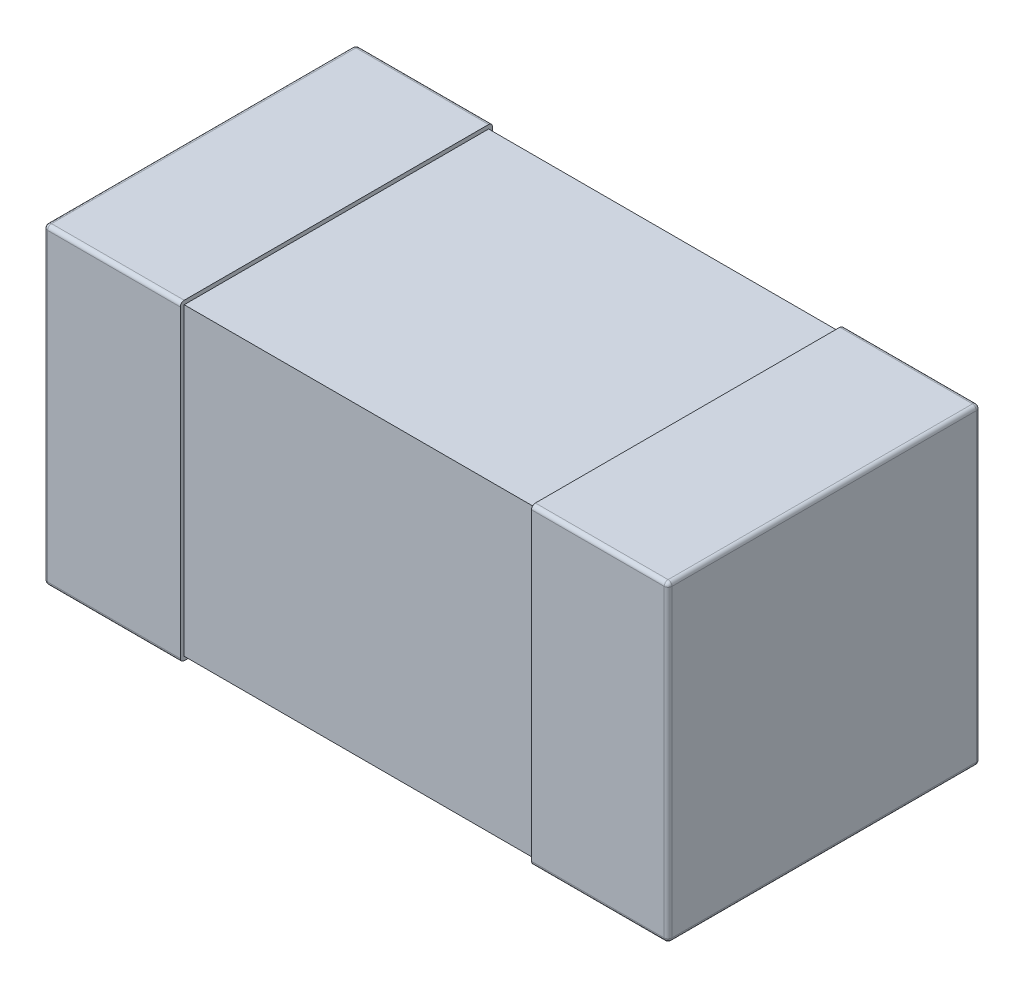
ISO-10303-21;
HEADER;
FILE_DESCRIPTION(('STEP AP214'),'2;1');
FILE_NAME('part.step','',(''),(''),'','','');
FILE_SCHEMA(('AUTOMOTIVE_DESIGN { 1 0 10303 214 1 1 1 1 }'));
ENDSEC;
DATA;
#1=APPLICATION_CONTEXT('core data for automotive mechanical design processes');
#2=APPLICATION_PROTOCOL_DEFINITION('international standard','automotive_design',2000,#1);
#3=PRODUCT_CONTEXT('',#1,'mechanical');
#4=PRODUCT('Part','Part','',(#3));
#5=PRODUCT_RELATED_PRODUCT_CATEGORY('part','',(#4));
#6=PRODUCT_DEFINITION_FORMATION('','',#4);
#7=PRODUCT_DEFINITION_CONTEXT('part definition',#1,'design');
#8=PRODUCT_DEFINITION('design','',#6,#7);
#9=PRODUCT_DEFINITION_SHAPE('','',#8);
#10=(LENGTH_UNIT() NAMED_UNIT(*) SI_UNIT(.MILLI.,.METRE.));
#11=(NAMED_UNIT(*) PLANE_ANGLE_UNIT() SI_UNIT($,.RADIAN.));
#12=(NAMED_UNIT(*) SI_UNIT($,.STERADIAN.) SOLID_ANGLE_UNIT());
#13=UNCERTAINTY_MEASURE_WITH_UNIT(LENGTH_MEASURE(1.E-05),#10,'distance_accuracy_value','');
#14=(GEOMETRIC_REPRESENTATION_CONTEXT(3) GLOBAL_UNCERTAINTY_ASSIGNED_CONTEXT((#13)) GLOBAL_UNIT_ASSIGNED_CONTEXT((#10,
#11,#12)) REPRESENTATION_CONTEXT('',''));
#15=CARTESIAN_POINT('',(0.,0.,0.));
#16=DIRECTION('',(0.,0.,1.));
#17=DIRECTION('',(1.,0.,0.));
#18=AXIS2_PLACEMENT_3D('',#15,#16,#17);
#19=CARTESIAN_POINT('',(-0.8,0.4,-0.4));
#20=DIRECTION('',(1.,0.,0.));
#21=DIRECTION('',(0.,0.,-1.));
#22=AXIS2_PLACEMENT_3D('',#19,#20,#21);
#23=PLANE('',#22);
#24=DIRECTION('',(0.,0.,1.));
#25=VECTOR('',#24,1.);
#26=CARTESIAN_POINT('',(-0.8,-0.39,-0.4));
#27=LINE('',#26,#25);
#28=CARTESIAN_POINT('',(-0.8,-0.39,0.39));
#29=VERTEX_POINT('',#28);
#30=CARTESIAN_POINT('',(-0.8,-0.39,-0.39));
#31=VERTEX_POINT('',#30);
#32=EDGE_CURVE('E414',#29,#31,#27,.F.);
#33=ORIENTED_EDGE('',*,*,#32,.F.);
#34=DIRECTION('',(0.,-1.,0.));
#35=VECTOR('',#34,1.);
#36=CARTESIAN_POINT('',(-0.8,0.4,0.39));
#37=LINE('',#36,#35);
#38=CARTESIAN_POINT('',(-0.8,0.39,0.39));
#39=VERTEX_POINT('',#38);
#40=EDGE_CURVE('E516',#39,#29,#37,.T.);
#41=ORIENTED_EDGE('',*,*,#40,.F.);
#42=DIRECTION('',(0.,0.,-1.));
#43=VECTOR('',#42,1.);
#44=CARTESIAN_POINT('',(-0.8,0.39,0.4));
#45=LINE('',#44,#43);
#46=CARTESIAN_POINT('',(-0.8,0.39,-0.39));
#47=VERTEX_POINT('',#46);
#48=EDGE_CURVE('E447',#47,#39,#45,.F.);
#49=ORIENTED_EDGE('',*,*,#48,.F.);
#50=DIRECTION('',(0.,-1.,0.));
#51=VECTOR('',#50,1.);
#52=CARTESIAN_POINT('',(-0.8,0.4,-0.39));
#53=LINE('',#52,#51);
#54=EDGE_CURVE('E507',#31,#47,#53,.F.);
#55=ORIENTED_EDGE('',*,*,#54,.F.);
#56=EDGE_LOOP('',(#33,#41,#49,#55));
#57=FACE_BOUND('',#56,.T.);
#58=ADVANCED_FACE('F17',(#57),#23,.F.);
#59=CARTESIAN_POINT('',(0.8,0.4,-0.4));
#60=DIRECTION('',(-1.,0.,0.));
#61=DIRECTION('',(0.,0.,1.));
#62=AXIS2_PLACEMENT_3D('',#59,#60,#61);
#63=PLANE('',#62);
#64=DIRECTION('',(0.,0.,-1.));
#65=VECTOR('',#64,1.);
#66=CARTESIAN_POINT('',(0.8,0.39,0.4));
#67=LINE('',#66,#65);
#68=CARTESIAN_POINT('',(0.8,0.39,0.39));
#69=VERTEX_POINT('',#68);
#70=CARTESIAN_POINT('',(0.8,0.39,-0.39));
#71=VERTEX_POINT('',#70);
#72=EDGE_CURVE('E364',#69,#71,#67,.T.);
#73=ORIENTED_EDGE('',*,*,#72,.F.);
#74=DIRECTION('',(0.,-1.,0.));
#75=VECTOR('',#74,1.);
#76=CARTESIAN_POINT('',(0.8,0.4,0.39));
#77=LINE('',#76,#75);
#78=CARTESIAN_POINT('',(0.8,-0.39,0.39));
#79=VERTEX_POINT('',#78);
#80=EDGE_CURVE('E488',#79,#69,#77,.F.);
#81=ORIENTED_EDGE('',*,*,#80,.F.);
#82=DIRECTION('',(0.,0.,1.));
#83=VECTOR('',#82,1.);
#84=CARTESIAN_POINT('',(0.8,-0.39,-0.4));
#85=LINE('',#84,#83);
#86=CARTESIAN_POINT('',(0.8,-0.39,-0.39));
#87=VERTEX_POINT('',#86);
#88=EDGE_CURVE('E304',#87,#79,#85,.T.);
#89=ORIENTED_EDGE('',*,*,#88,.F.);
#90=DIRECTION('',(0.,-1.,0.));
#91=VECTOR('',#90,1.);
#92=CARTESIAN_POINT('',(0.8,0.4,-0.39));
#93=LINE('',#92,#91);
#94=EDGE_CURVE('E497',#71,#87,#93,.T.);
#95=ORIENTED_EDGE('',*,*,#94,.F.);
#96=EDGE_LOOP('',(#73,#81,#89,#95));
#97=FACE_BOUND('',#96,.T.);
#98=ADVANCED_FACE('F477',(#97),#63,.F.);
#99=CARTESIAN_POINT('',(-0.79,-0.39,0.39));
#100=DIRECTION('',(1.,0.,0.));
#101=DIRECTION('',(0.,-1.,0.));
#102=AXIS2_PLACEMENT_3D('',#99,#100,#101);
#103=SPHERICAL_SURFACE('',#102,0.01);
#104=CARTESIAN_POINT('',(-0.79,-0.39,0.39));
#105=DIRECTION('',(0.,-1.,0.));
#106=DIRECTION('',(0.,0.,-1.));
#107=AXIS2_PLACEMENT_3D('',#104,#105,#106);
#108=CIRCLE('',#107,0.01);
#109=CARTESIAN_POINT('',(-0.79,-0.39,0.4));
#110=VERTEX_POINT('',#109);
#111=EDGE_CURVE('E519',#29,#110,#108,.F.);
#112=ORIENTED_EDGE('',*,*,#111,.F.);
#113=CARTESIAN_POINT('',(-0.79,-0.39,0.39));
#114=DIRECTION('',(0.,0.,1.));
#115=DIRECTION('',(1.,0.,0.));
#116=AXIS2_PLACEMENT_3D('',#113,#114,#115);
#117=CIRCLE('',#116,0.01);
#118=CARTESIAN_POINT('',(-0.79,-0.4,0.39));
#119=VERTEX_POINT('',#118);
#120=EDGE_CURVE('E401',#119,#29,#117,.F.);
#121=ORIENTED_EDGE('',*,*,#120,.F.);
#122=CARTESIAN_POINT('',(-0.79,-0.39,0.39));
#123=DIRECTION('',(1.,0.,0.));
#124=DIRECTION('',(0.,0.,-1.));
#125=AXIS2_PLACEMENT_3D('',#122,#123,#124);
#126=CIRCLE('',#125,0.01);
#127=EDGE_CURVE('E196',#110,#119,#126,.T.);
#128=ORIENTED_EDGE('',*,*,#127,.F.);
#129=EDGE_LOOP('',(#112,#121,#128));
#130=FACE_BOUND('',#129,.T.);
#131=ADVANCED_FACE('F473',(#130),#103,.T.);
#132=CARTESIAN_POINT('',(-0.79,0.4,0.39));
#133=DIRECTION('',(0.,-1.,0.));
#134=DIRECTION('',(0.,0.,-1.));
#135=AXIS2_PLACEMENT_3D('',#132,#133,#134);
#136=CYLINDRICAL_SURFACE('',#135,0.01);
#137=ORIENTED_EDGE('',*,*,#111,.T.);
#138=DIRECTION('',(0.,1.,0.));
#139=VECTOR('',#138,1.);
#140=CARTESIAN_POINT('',(-0.79,0.4,0.4));
#141=LINE('',#140,#139);
#142=CARTESIAN_POINT('',(-0.79,0.389999999999998,0.4));
#143=VERTEX_POINT('',#142);
#144=EDGE_CURVE('E195',#110,#143,#141,.T.);
#145=ORIENTED_EDGE('',*,*,#144,.T.);
#146=CARTESIAN_POINT('',(-0.79,0.39,0.39));
#147=DIRECTION('',(0.,-1.,-6.71279188273423E-13));
#148=DIRECTION('',(1.,0.,0.));
#149=AXIS2_PLACEMENT_3D('',#146,#147,#148);
#150=CIRCLE('',#149,0.01);
#151=EDGE_CURVE('E457',#39,#143,#150,.F.);
#152=ORIENTED_EDGE('',*,*,#151,.F.);
#153=ORIENTED_EDGE('',*,*,#40,.T.);
#154=EDGE_LOOP('',(#137,#145,#152,#153));
#155=FACE_BOUND('',#154,.T.);
#156=ADVANCED_FACE('F469',(#155),#136,.T.);
#157=CARTESIAN_POINT('',(-0.79,0.39,0.39));
#158=DIRECTION('',(1.,0.,0.));
#159=DIRECTION('',(0.,-1.,0.));
#160=AXIS2_PLACEMENT_3D('',#157,#158,#159);
#161=SPHERICAL_SURFACE('',#160,0.01);
#162=CARTESIAN_POINT('',(-0.79,0.39,0.39));
#163=DIRECTION('',(0.,0.,-1.));
#164=DIRECTION('',(-1.,0.,0.));
#165=AXIS2_PLACEMENT_3D('',#162,#163,#164);
#166=CIRCLE('',#165,0.01);
#167=CARTESIAN_POINT('',(-0.79,0.4,0.39));
#168=VERTEX_POINT('',#167);
#169=EDGE_CURVE('E454',#39,#168,#166,.T.);
#170=ORIENTED_EDGE('',*,*,#169,.F.);
#171=ORIENTED_EDGE('',*,*,#151,.T.);
#172=CARTESIAN_POINT('',(-0.79,0.39,0.39));
#173=DIRECTION('',(-1.,0.,0.));
#174=DIRECTION('',(0.,0.,1.));
#175=AXIS2_PLACEMENT_3D('',#172,#173,#174);
#176=CIRCLE('',#175,0.01);
#177=EDGE_CURVE('E292',#168,#143,#176,.F.);
#178=ORIENTED_EDGE('',*,*,#177,.F.);
#179=EDGE_LOOP('',(#170,#171,#178));
#180=FACE_BOUND('',#179,.T.);
#181=ADVANCED_FACE('F466',(#180),#161,.T.);
#182=CARTESIAN_POINT('',(-0.79,0.39,0.4));
#183=DIRECTION('',(0.,0.,-1.));
#184=DIRECTION('',(-1.,0.,0.));
#185=AXIS2_PLACEMENT_3D('',#182,#183,#184);
#186=CYLINDRICAL_SURFACE('',#185,0.01);
#187=CARTESIAN_POINT('',(-0.79,0.39,-0.39));
#188=DIRECTION('',(0.,0.,1.));
#189=DIRECTION('',(1.,0.,0.));
#190=AXIS2_PLACEMENT_3D('',#187,#188,#189);
#191=CIRCLE('',#190,0.01);
#192=CARTESIAN_POINT('',(-0.79,0.4,-0.39));
#193=VERTEX_POINT('',#192);
#194=EDGE_CURVE('E443',#47,#193,#191,.F.);
#195=ORIENTED_EDGE('',*,*,#194,.F.);
#196=ORIENTED_EDGE('',*,*,#48,.T.);
#197=ORIENTED_EDGE('',*,*,#169,.T.);
#198=DIRECTION('',(0.,0.,1.));
#199=VECTOR('',#198,1.);
#200=CARTESIAN_POINT('',(-0.79,0.4,0.4));
#201=LINE('',#200,#199);
#202=EDGE_CURVE('E287',#193,#168,#201,.T.);
#203=ORIENTED_EDGE('',*,*,#202,.F.);
#204=EDGE_LOOP('',(#195,#196,#197,#203));
#205=FACE_BOUND('',#204,.T.);
#206=ADVANCED_FACE('F435',(#205),#186,.T.);
#207=CARTESIAN_POINT('',(-0.79,0.39,-0.39));
#208=DIRECTION('',(1.,0.,0.));
#209=DIRECTION('',(0.,-1.,0.));
#210=AXIS2_PLACEMENT_3D('',#207,#208,#209);
#211=SPHERICAL_SURFACE('',#210,0.01);
#212=CARTESIAN_POINT('',(-0.79,0.39,-0.39));
#213=DIRECTION('',(1.,0.,0.));
#214=DIRECTION('',(0.,0.,-1.));
#215=AXIS2_PLACEMENT_3D('',#212,#213,#214);
#216=CIRCLE('',#215,0.01);
#217=CARTESIAN_POINT('',(-0.79,0.39,-0.4));
#218=VERTEX_POINT('',#217);
#219=EDGE_CURVE('E281',#218,#193,#216,.T.);
#220=ORIENTED_EDGE('',*,*,#219,.F.);
#221=CARTESIAN_POINT('',(-0.79,0.39,-0.39));
#222=DIRECTION('',(0.,-1.,0.));
#223=DIRECTION('',(0.,0.,-1.));
#224=AXIS2_PLACEMENT_3D('',#221,#222,#223);
#225=CIRCLE('',#224,0.01);
#226=EDGE_CURVE('E446',#47,#218,#225,.T.);
#227=ORIENTED_EDGE('',*,*,#226,.F.);
#228=ORIENTED_EDGE('',*,*,#194,.T.);
#229=EDGE_LOOP('',(#220,#227,#228));
#230=FACE_BOUND('',#229,.T.);
#231=ADVANCED_FACE('F430',(#230),#211,.T.);
#232=CARTESIAN_POINT('',(-0.79,0.4,-0.39));
#233=DIRECTION('',(0.,-1.,0.));
#234=DIRECTION('',(0.,0.,-1.));
#235=AXIS2_PLACEMENT_3D('',#232,#233,#234);
#236=CYLINDRICAL_SURFACE('',#235,0.01);
#237=CARTESIAN_POINT('',(-0.79,-0.39,-0.39));
#238=DIRECTION('',(0.,1.,-6.71302073028327E-13));
#239=DIRECTION('',(1.,0.,0.));
#240=AXIS2_PLACEMENT_3D('',#237,#238,#239);
#241=CIRCLE('',#240,0.01);
#242=CARTESIAN_POINT('',(-0.79,-0.390000000000002,-0.4));
#243=VERTEX_POINT('',#242);
#244=EDGE_CURVE('E402',#31,#243,#241,.F.);
#245=ORIENTED_EDGE('',*,*,#244,.F.);
#246=ORIENTED_EDGE('',*,*,#54,.T.);
#247=ORIENTED_EDGE('',*,*,#226,.T.);
#248=DIRECTION('',(0.,1.,0.));
#249=VECTOR('',#248,1.);
#250=CARTESIAN_POINT('',(-0.79,0.4,-0.4));
#251=LINE('',#250,#249);
#252=EDGE_CURVE('E275',#218,#243,#251,.F.);
#253=ORIENTED_EDGE('',*,*,#252,.T.);
#254=EDGE_LOOP('',(#245,#246,#247,#253));
#255=FACE_BOUND('',#254,.T.);
#256=ADVANCED_FACE('F426',(#255),#236,.T.);
#257=CARTESIAN_POINT('',(-0.79,-0.39,-0.39));
#258=DIRECTION('',(1.,0.,0.));
#259=DIRECTION('',(0.,-1.,0.));
#260=AXIS2_PLACEMENT_3D('',#257,#258,#259);
#261=SPHERICAL_SURFACE('',#260,0.01);
#262=CARTESIAN_POINT('',(-0.79,-0.39,-0.39));
#263=DIRECTION('',(-1.,0.,0.));
#264=DIRECTION('',(0.,0.,1.));
#265=AXIS2_PLACEMENT_3D('',#262,#263,#264);
#266=CIRCLE('',#265,0.01);
#267=CARTESIAN_POINT('',(-0.79,-0.4,-0.39));
#268=VERTEX_POINT('',#267);
#269=EDGE_CURVE('E269',#268,#243,#266,.F.);
#270=ORIENTED_EDGE('',*,*,#269,.F.);
#271=CARTESIAN_POINT('',(-0.79,-0.39,-0.39));
#272=DIRECTION('',(0.,0.,1.));
#273=DIRECTION('',(1.,0.,0.));
#274=AXIS2_PLACEMENT_3D('',#271,#272,#273);
#275=CIRCLE('',#274,0.01);
#276=EDGE_CURVE('E398',#31,#268,#275,.T.);
#277=ORIENTED_EDGE('',*,*,#276,.F.);
#278=ORIENTED_EDGE('',*,*,#244,.T.);
#279=EDGE_LOOP('',(#270,#277,#278));
#280=FACE_BOUND('',#279,.T.);
#281=ADVANCED_FACE('F423',(#280),#261,.T.);
#282=CARTESIAN_POINT('',(-0.79,-0.39,-0.4));
#283=DIRECTION('',(0.,0.,1.));
#284=DIRECTION('',(1.,0.,0.));
#285=AXIS2_PLACEMENT_3D('',#282,#283,#284);
#286=CYLINDRICAL_SURFACE('',#285,0.01);
#287=ORIENTED_EDGE('',*,*,#120,.T.);
#288=ORIENTED_EDGE('',*,*,#32,.T.);
#289=ORIENTED_EDGE('',*,*,#276,.T.);
#290=DIRECTION('',(0.,0.,1.));
#291=VECTOR('',#290,1.);
#292=CARTESIAN_POINT('',(-0.79,-0.4,0.4));
#293=LINE('',#292,#291);
#294=EDGE_CURVE('E260',#268,#119,#293,.T.);
#295=ORIENTED_EDGE('',*,*,#294,.T.);
#296=EDGE_LOOP('',(#287,#288,#289,#295));
#297=FACE_BOUND('',#296,.T.);
#298=ADVANCED_FACE('F386',(#297),#286,.T.);
#299=CARTESIAN_POINT('',(0.79,-0.39,-0.39));
#300=DIRECTION('',(-1.,0.,0.));
#301=DIRECTION('',(0.,1.,0.));
#302=AXIS2_PLACEMENT_3D('',#299,#300,#301);
#303=SPHERICAL_SURFACE('',#302,0.01);
#304=CARTESIAN_POINT('',(0.79,-0.39,-0.39));
#305=DIRECTION('',(0.,0.,1.));
#306=DIRECTION('',(1.,0.,0.));
#307=AXIS2_PLACEMENT_3D('',#304,#305,#306);
#308=CIRCLE('',#307,0.01);
#309=CARTESIAN_POINT('',(0.79,-0.4,-0.39));
#310=VERTEX_POINT('',#309);
#311=EDGE_CURVE('E315',#310,#87,#308,.T.);
#312=ORIENTED_EDGE('',*,*,#311,.F.);
#313=CARTESIAN_POINT('',(0.79,-0.39,-0.39));
#314=DIRECTION('',(1.,0.,0.));
#315=DIRECTION('',(0.,0.,-1.));
#316=AXIS2_PLACEMENT_3D('',#313,#314,#315);
#317=CIRCLE('',#316,0.01);
#318=CARTESIAN_POINT('',(0.79,-0.39,-0.4));
#319=VERTEX_POINT('',#318);
#320=EDGE_CURVE('E254',#319,#310,#317,.F.);
#321=ORIENTED_EDGE('',*,*,#320,.F.);
#322=CARTESIAN_POINT('',(0.79,-0.39,-0.39));
#323=DIRECTION('',(0.,-1.,0.));
#324=DIRECTION('',(0.,0.,-1.));
#325=AXIS2_PLACEMENT_3D('',#322,#323,#324);
#326=CIRCLE('',#325,0.01);
#327=EDGE_CURVE('E500',#87,#319,#326,.F.);
#328=ORIENTED_EDGE('',*,*,#327,.F.);
#329=EDGE_LOOP('',(#312,#321,#328));
#330=FACE_BOUND('',#329,.T.);
#331=ADVANCED_FACE('F381',(#330),#303,.T.);
#332=CARTESIAN_POINT('',(0.79,0.4,-0.39));
#333=DIRECTION('',(0.,-1.,0.));
#334=DIRECTION('',(0.,0.,-1.));
#335=AXIS2_PLACEMENT_3D('',#332,#333,#334);
#336=CYLINDRICAL_SURFACE('',#335,0.01);
#337=ORIENTED_EDGE('',*,*,#327,.T.);
#338=DIRECTION('',(0.,1.,0.));
#339=VECTOR('',#338,1.);
#340=CARTESIAN_POINT('',(0.79,0.4,-0.4));
#341=LINE('',#340,#339);
#342=CARTESIAN_POINT('',(0.79,0.389999999999998,-0.4));
#343=VERTEX_POINT('',#342);
#344=EDGE_CURVE('E253',#319,#343,#341,.T.);
#345=ORIENTED_EDGE('',*,*,#344,.T.);
#346=CARTESIAN_POINT('',(0.79,0.39,-0.39));
#347=DIRECTION('',(0.,-1.,6.71401652953337E-13));
#348=DIRECTION('',(-1.,0.,0.));
#349=AXIS2_PLACEMENT_3D('',#346,#347,#348);
#350=CIRCLE('',#349,0.01);
#351=EDGE_CURVE('E372',#71,#343,#350,.F.);
#352=ORIENTED_EDGE('',*,*,#351,.F.);
#353=ORIENTED_EDGE('',*,*,#94,.T.);
#354=EDGE_LOOP('',(#337,#345,#352,#353));
#355=FACE_BOUND('',#354,.T.);
#356=ADVANCED_FACE('F377',(#355),#336,.T.);
#357=CARTESIAN_POINT('',(0.79,0.39,-0.39));
#358=DIRECTION('',(-1.,0.,0.));
#359=DIRECTION('',(0.,1.,0.));
#360=AXIS2_PLACEMENT_3D('',#357,#358,#359);
#361=SPHERICAL_SURFACE('',#360,0.01);
#362=ORIENTED_EDGE('',*,*,#351,.T.);
#363=CARTESIAN_POINT('',(0.79,0.39,-0.39));
#364=DIRECTION('',(-1.,0.,0.));
#365=DIRECTION('',(0.,0.,1.));
#366=AXIS2_PLACEMENT_3D('',#363,#364,#365);
#367=CIRCLE('',#366,0.01);
#368=CARTESIAN_POINT('',(0.79,0.4,-0.39));
#369=VERTEX_POINT('',#368);
#370=EDGE_CURVE('E247',#369,#343,#367,.T.);
#371=ORIENTED_EDGE('',*,*,#370,.F.);
#372=CARTESIAN_POINT('',(0.79,0.39,-0.39));
#373=DIRECTION('',(0.,0.,-1.));
#374=DIRECTION('',(-1.,0.,0.));
#375=AXIS2_PLACEMENT_3D('',#372,#373,#374);
#376=CIRCLE('',#375,0.01);
#377=EDGE_CURVE('E355',#71,#369,#376,.F.);
#378=ORIENTED_EDGE('',*,*,#377,.F.);
#379=EDGE_LOOP('',(#362,#371,#378));
#380=FACE_BOUND('',#379,.T.);
#381=ADVANCED_FACE('F374',(#380),#361,.T.);
#382=CARTESIAN_POINT('',(0.79,0.39,0.4));
#383=DIRECTION('',(0.,0.,-1.));
#384=DIRECTION('',(-1.,0.,0.));
#385=AXIS2_PLACEMENT_3D('',#382,#383,#384);
#386=CYLINDRICAL_SURFACE('',#385,0.01);
#387=ORIENTED_EDGE('',*,*,#377,.T.);
#388=DIRECTION('',(0.,0.,1.));
#389=VECTOR('',#388,1.);
#390=CARTESIAN_POINT('',(0.79,0.4,0.4));
#391=LINE('',#390,#389);
#392=CARTESIAN_POINT('',(0.79,0.4,0.39));
#393=VERTEX_POINT('',#392);
#394=EDGE_CURVE('E241',#393,#369,#391,.F.);
#395=ORIENTED_EDGE('',*,*,#394,.F.);
#396=CARTESIAN_POINT('',(0.79,0.39,0.39));
#397=DIRECTION('',(0.,0.,-1.));
#398=DIRECTION('',(-1.,0.,0.));
#399=AXIS2_PLACEMENT_3D('',#396,#397,#398);
#400=CIRCLE('',#399,0.01);
#401=EDGE_CURVE('E351',#69,#393,#400,.F.);
#402=ORIENTED_EDGE('',*,*,#401,.F.);
#403=ORIENTED_EDGE('',*,*,#72,.T.);
#404=EDGE_LOOP('',(#387,#395,#402,#403));
#405=FACE_BOUND('',#404,.T.);
#406=ADVANCED_FACE('F343',(#405),#386,.T.);
#407=CARTESIAN_POINT('',(0.79,0.39,0.39));
#408=DIRECTION('',(-1.,0.,0.));
#409=DIRECTION('',(0.,1.,0.));
#410=AXIS2_PLACEMENT_3D('',#407,#408,#409);
#411=SPHERICAL_SURFACE('',#410,0.01);
#412=CARTESIAN_POINT('',(0.79,0.39,0.39));
#413=DIRECTION('',(0.,-1.,0.));
#414=DIRECTION('',(0.,0.,-1.));
#415=AXIS2_PLACEMENT_3D('',#412,#413,#414);
#416=CIRCLE('',#415,0.01);
#417=CARTESIAN_POINT('',(0.79,0.39,0.4));
#418=VERTEX_POINT('',#417);
#419=EDGE_CURVE('E354',#69,#418,#416,.T.);
#420=ORIENTED_EDGE('',*,*,#419,.F.);
#421=ORIENTED_EDGE('',*,*,#401,.T.);
#422=CARTESIAN_POINT('',(0.79,0.39,0.39));
#423=DIRECTION('',(1.,0.,0.));
#424=DIRECTION('',(0.,0.,-1.));
#425=AXIS2_PLACEMENT_3D('',#422,#423,#424);
#426=CIRCLE('',#425,0.01);
#427=EDGE_CURVE('E235',#418,#393,#426,.F.);
#428=ORIENTED_EDGE('',*,*,#427,.F.);
#429=EDGE_LOOP('',(#420,#421,#428));
#430=FACE_BOUND('',#429,.T.);
#431=ADVANCED_FACE('F338',(#430),#411,.T.);
#432=CARTESIAN_POINT('',(0.79,0.4,0.39));
#433=DIRECTION('',(0.,-1.,0.));
#434=DIRECTION('',(0.,0.,-1.));
#435=AXIS2_PLACEMENT_3D('',#432,#433,#434);
#436=CYLINDRICAL_SURFACE('',#435,0.01);
#437=CARTESIAN_POINT('',(0.79,-0.39,0.39));
#438=DIRECTION('',(0.,1.,6.71646582313167E-13));
#439=DIRECTION('',(-1.,0.,0.));
#440=AXIS2_PLACEMENT_3D('',#437,#438,#439);
#441=CIRCLE('',#440,0.01);
#442=CARTESIAN_POINT('',(0.79,-0.390000000000002,0.4));
#443=VERTEX_POINT('',#442);
#444=EDGE_CURVE('E318',#79,#443,#441,.F.);
#445=ORIENTED_EDGE('',*,*,#444,.F.);
#446=ORIENTED_EDGE('',*,*,#80,.T.);
#447=ORIENTED_EDGE('',*,*,#419,.T.);
#448=DIRECTION('',(0.,1.,0.));
#449=VECTOR('',#448,1.);
#450=CARTESIAN_POINT('',(0.79,0.4,0.4));
#451=LINE('',#450,#449);
#452=EDGE_CURVE('E229',#418,#443,#451,.F.);
#453=ORIENTED_EDGE('',*,*,#452,.T.);
#454=EDGE_LOOP('',(#445,#446,#447,#453));
#455=FACE_BOUND('',#454,.T.);
#456=ADVANCED_FACE('F333',(#455),#436,.T.);
#457=CARTESIAN_POINT('',(0.79,-0.39,0.39));
#458=DIRECTION('',(-1.,0.,0.));
#459=DIRECTION('',(0.,1.,0.));
#460=AXIS2_PLACEMENT_3D('',#457,#458,#459);
#461=SPHERICAL_SURFACE('',#460,0.01);
#462=CARTESIAN_POINT('',(0.79,-0.39,0.39));
#463=DIRECTION('',(0.,0.,1.));
#464=DIRECTION('',(1.,0.,0.));
#465=AXIS2_PLACEMENT_3D('',#462,#463,#464);
#466=CIRCLE('',#465,0.01);
#467=CARTESIAN_POINT('',(0.79,-0.4,0.39));
#468=VERTEX_POINT('',#467);
#469=EDGE_CURVE('E301',#79,#468,#466,.F.);
#470=ORIENTED_EDGE('',*,*,#469,.F.);
#471=ORIENTED_EDGE('',*,*,#444,.T.);
#472=CARTESIAN_POINT('',(0.79,-0.39,0.39));
#473=DIRECTION('',(-1.,0.,0.));
#474=DIRECTION('',(0.,0.,1.));
#475=AXIS2_PLACEMENT_3D('',#472,#473,#474);
#476=CIRCLE('',#475,0.01);
#477=EDGE_CURVE('E223',#468,#443,#476,.T.);
#478=ORIENTED_EDGE('',*,*,#477,.F.);
#479=EDGE_LOOP('',(#470,#471,#478));
#480=FACE_BOUND('',#479,.T.);
#481=ADVANCED_FACE('F328',(#480),#461,.T.);
#482=CARTESIAN_POINT('',(0.79,-0.39,-0.4));
#483=DIRECTION('',(0.,0.,1.));
#484=DIRECTION('',(1.,0.,0.));
#485=AXIS2_PLACEMENT_3D('',#482,#483,#484);
#486=CYLINDRICAL_SURFACE('',#485,0.01);
#487=ORIENTED_EDGE('',*,*,#469,.T.);
#488=DIRECTION('',(0.,0.,1.));
#489=VECTOR('',#488,1.);
#490=CARTESIAN_POINT('',(0.79,-0.4,0.4));
#491=LINE('',#490,#489);
#492=EDGE_CURVE('E210',#468,#310,#491,.F.);
#493=ORIENTED_EDGE('',*,*,#492,.T.);
#494=ORIENTED_EDGE('',*,*,#311,.T.);
#495=ORIENTED_EDGE('',*,*,#88,.T.);
#496=EDGE_LOOP('',(#487,#493,#494,#495));
#497=FACE_BOUND('',#496,.T.);
#498=ADVANCED_FACE('F332',(#497),#486,.T.);
#499=CARTESIAN_POINT('',(-0.8,-0.39,0.39));
#500=DIRECTION('',(1.,0.,0.));
#501=DIRECTION('',(0.,0.,-1.));
#502=AXIS2_PLACEMENT_3D('',#499,#500,#501);
#503=CYLINDRICAL_SURFACE('',#502,0.01);
#504=ORIENTED_EDGE('',*,*,#127,.T.);
#505=DIRECTION('',(1.,0.,0.));
#506=VECTOR('',#505,1.);
#507=CARTESIAN_POINT('',(-0.8,-0.4,0.39));
#508=LINE('',#507,#506);
#509=CARTESIAN_POINT('',(-0.45,-0.4,0.39));
#510=VERTEX_POINT('',#509);
#511=EDGE_CURVE('E177',#119,#510,#508,.T.);
#512=ORIENTED_EDGE('',*,*,#511,.T.);
#513=CARTESIAN_POINT('',(-0.45,-0.39,0.39));
#514=DIRECTION('',(1.,0.,0.));
#515=DIRECTION('',(0.,0.,-1.));
#516=AXIS2_PLACEMENT_3D('',#513,#514,#515);
#517=CIRCLE('',#516,0.01);
#518=CARTESIAN_POINT('',(-0.45,-0.39,0.4));
#519=VERTEX_POINT('',#518);
#520=EDGE_CURVE('E20',#510,#519,#517,.F.);
#521=ORIENTED_EDGE('',*,*,#520,.T.);
#522=DIRECTION('',(-1.,0.,0.));
#523=VECTOR('',#522,1.);
#524=CARTESIAN_POINT('',(-0.8,-0.39,0.4));
#525=LINE('',#524,#523);
#526=EDGE_CURVE('E183',#519,#110,#525,.T.);
#527=ORIENTED_EDGE('',*,*,#526,.T.);
#528=EDGE_LOOP('',(#504,#512,#521,#527));
#529=FACE_BOUND('',#528,.T.);
#530=ADVANCED_FACE('F182',(#529),#503,.T.);
#531=CARTESIAN_POINT('',(-0.8,0.4,0.4));
#532=DIRECTION('',(0.,0.,-1.));
#533=DIRECTION('',(-1.,0.,0.));
#534=AXIS2_PLACEMENT_3D('',#531,#532,#533);
#535=PLANE('',#534);
#536=ORIENTED_EDGE('',*,*,#526,.F.);
#537=DIRECTION('',(0.,1.,0.));
#538=VECTOR('',#537,1.);
#539=CARTESIAN_POINT('',(-0.45,0.4,0.4));
#540=LINE('',#539,#538);
#541=CARTESIAN_POINT('',(-0.45,0.39,0.4));
#542=VERTEX_POINT('',#541);
#543=EDGE_CURVE('E188',#519,#542,#540,.T.);
#544=ORIENTED_EDGE('',*,*,#543,.T.);
#545=DIRECTION('',(-1.,0.,0.));
#546=VECTOR('',#545,1.);
#547=CARTESIAN_POINT('',(-0.8,0.39,0.4));
#548=LINE('',#547,#546);
#549=EDGE_CURVE('E290',#143,#542,#548,.F.);
#550=ORIENTED_EDGE('',*,*,#549,.F.);
#551=ORIENTED_EDGE('',*,*,#144,.F.);
#552=EDGE_LOOP('',(#536,#544,#550,#551));
#553=FACE_BOUND('',#552,.T.);
#554=ADVANCED_FACE('F192',(#553),#535,.F.);
#555=CARTESIAN_POINT('',(-0.8,0.39,0.39));
#556=DIRECTION('',(-1.,0.,0.));
#557=DIRECTION('',(0.,0.,1.));
#558=AXIS2_PLACEMENT_3D('',#555,#556,#557);
#559=CYLINDRICAL_SURFACE('',#558,0.01);
#560=ORIENTED_EDGE('',*,*,#177,.T.);
#561=ORIENTED_EDGE('',*,*,#549,.T.);
#562=CARTESIAN_POINT('',(-0.45,0.39,0.39));
#563=DIRECTION('',(-1.,0.,0.));
#564=DIRECTION('',(0.,0.,1.));
#565=AXIS2_PLACEMENT_3D('',#562,#563,#564);
#566=CIRCLE('',#565,0.01);
#567=CARTESIAN_POINT('',(-0.45,0.4,0.39));
#568=VERTEX_POINT('',#567);
#569=EDGE_CURVE('E202',#542,#568,#566,.T.);
#570=ORIENTED_EDGE('',*,*,#569,.T.);
#571=DIRECTION('',(1.,0.,0.));
#572=VECTOR('',#571,1.);
#573=CARTESIAN_POINT('',(-0.8,0.4,0.39));
#574=LINE('',#573,#572);
#575=EDGE_CURVE('E284',#168,#568,#574,.T.);
#576=ORIENTED_EDGE('',*,*,#575,.F.);
#577=EDGE_LOOP('',(#560,#561,#570,#576));
#578=FACE_BOUND('',#577,.T.);
#579=ADVANCED_FACE('F575',(#578),#559,.T.);
#580=CARTESIAN_POINT('',(-0.8,0.4,0.4));
#581=DIRECTION('',(0.,1.,0.));
#582=DIRECTION('',(0.,0.,1.));
#583=AXIS2_PLACEMENT_3D('',#580,#581,#582);
#584=PLANE('',#583);
#585=ORIENTED_EDGE('',*,*,#202,.T.);
#586=ORIENTED_EDGE('',*,*,#575,.T.);
#587=DIRECTION('',(0.,0.,1.));
#588=VECTOR('',#587,1.);
#589=CARTESIAN_POINT('',(-0.45,0.4,-0.4));
#590=LINE('',#589,#588);
#591=CARTESIAN_POINT('',(-0.45,0.4,-0.39));
#592=VERTEX_POINT('',#591);
#593=EDGE_CURVE('E204',#568,#592,#590,.F.);
#594=ORIENTED_EDGE('',*,*,#593,.T.);
#595=DIRECTION('',(1.,0.,0.));
#596=VECTOR('',#595,1.);
#597=CARTESIAN_POINT('',(-0.8,0.4,-0.39));
#598=LINE('',#597,#596);
#599=EDGE_CURVE('E276',#193,#592,#598,.T.);
#600=ORIENTED_EDGE('',*,*,#599,.F.);
#601=EDGE_LOOP('',(#585,#586,#594,#600));
#602=FACE_BOUND('',#601,.T.);
#603=ADVANCED_FACE('F546',(#602),#584,.T.);
#604=CARTESIAN_POINT('',(-0.8,0.39,-0.39));
#605=DIRECTION('',(1.,0.,0.));
#606=DIRECTION('',(0.,0.,-1.));
#607=AXIS2_PLACEMENT_3D('',#604,#605,#606);
#608=CYLINDRICAL_SURFACE('',#607,0.01);
#609=ORIENTED_EDGE('',*,*,#219,.T.);
#610=ORIENTED_EDGE('',*,*,#599,.T.);
#611=CARTESIAN_POINT('',(-0.45,0.39,-0.39));
#612=DIRECTION('',(1.,0.,0.));
#613=DIRECTION('',(0.,0.,-1.));
#614=AXIS2_PLACEMENT_3D('',#611,#612,#613);
#615=CIRCLE('',#614,0.01);
#616=CARTESIAN_POINT('',(-0.45,0.39,-0.4));
#617=VERTEX_POINT('',#616);
#618=EDGE_CURVE('E539',#592,#617,#615,.F.);
#619=ORIENTED_EDGE('',*,*,#618,.T.);
#620=DIRECTION('',(1.,0.,0.));
#621=VECTOR('',#620,1.);
#622=CARTESIAN_POINT('',(-0.8,0.39,-0.4));
#623=LINE('',#622,#621);
#624=EDGE_CURVE('E272',#617,#218,#623,.F.);
#625=ORIENTED_EDGE('',*,*,#624,.T.);
#626=EDGE_LOOP('',(#609,#610,#619,#625));
#627=FACE_BOUND('',#626,.T.);
#628=ADVANCED_FACE('F549',(#627),#608,.T.);
#629=CARTESIAN_POINT('',(-0.8,0.4,-0.4));
#630=DIRECTION('',(0.,0.,1.));
#631=DIRECTION('',(1.,0.,0.));
#632=AXIS2_PLACEMENT_3D('',#629,#630,#631);
#633=PLANE('',#632);
#634=DIRECTION('',(-1.,0.,0.));
#635=VECTOR('',#634,1.);
#636=CARTESIAN_POINT('',(-0.8,-0.39,-0.4));
#637=LINE('',#636,#635);
#638=CARTESIAN_POINT('',(-0.45,-0.39,-0.4));
#639=VERTEX_POINT('',#638);
#640=EDGE_CURVE('E264',#243,#639,#637,.F.);
#641=ORIENTED_EDGE('',*,*,#640,.F.);
#642=ORIENTED_EDGE('',*,*,#252,.F.);
#643=ORIENTED_EDGE('',*,*,#624,.F.);
#644=DIRECTION('',(0.,1.,0.));
#645=VECTOR('',#644,1.);
#646=CARTESIAN_POINT('',(-0.45,0.4,-0.4));
#647=LINE('',#646,#645);
#648=EDGE_CURVE('E538',#617,#639,#647,.F.);
#649=ORIENTED_EDGE('',*,*,#648,.T.);
#650=EDGE_LOOP('',(#641,#642,#643,#649));
#651=FACE_BOUND('',#650,.T.);
#652=ADVANCED_FACE('F553',(#651),#633,.F.);
#653=CARTESIAN_POINT('',(-0.8,-0.39,-0.39));
#654=DIRECTION('',(-1.,0.,0.));
#655=DIRECTION('',(0.,0.,1.));
#656=AXIS2_PLACEMENT_3D('',#653,#654,#655);
#657=CYLINDRICAL_SURFACE('',#656,0.01);
#658=ORIENTED_EDGE('',*,*,#269,.T.);
#659=ORIENTED_EDGE('',*,*,#640,.T.);
#660=CARTESIAN_POINT('',(-0.45,-0.39,-0.39));
#661=DIRECTION('',(-1.,0.,0.));
#662=DIRECTION('',(0.,0.,1.));
#663=AXIS2_PLACEMENT_3D('',#660,#661,#662);
#664=CIRCLE('',#663,0.01);
#665=CARTESIAN_POINT('',(-0.45,-0.4,-0.39));
#666=VERTEX_POINT('',#665);
#667=EDGE_CURVE('E535',#639,#666,#664,.T.);
#668=ORIENTED_EDGE('',*,*,#667,.T.);
#669=DIRECTION('',(1.,0.,0.));
#670=VECTOR('',#669,1.);
#671=CARTESIAN_POINT('',(-0.8,-0.4,-0.39));
#672=LINE('',#671,#670);
#673=EDGE_CURVE('E257',#666,#268,#672,.F.);
#674=ORIENTED_EDGE('',*,*,#673,.T.);
#675=EDGE_LOOP('',(#658,#659,#668,#674));
#676=FACE_BOUND('',#675,.T.);
#677=ADVANCED_FACE('F556',(#676),#657,.T.);
#678=CARTESIAN_POINT('',(-0.8,-0.4,0.4));
#679=DIRECTION('',(0.,1.,0.));
#680=DIRECTION('',(0.,0.,1.));
#681=AXIS2_PLACEMENT_3D('',#678,#679,#680);
#682=PLANE('',#681);
#683=ORIENTED_EDGE('',*,*,#673,.F.);
#684=DIRECTION('',(0.,0.,1.));
#685=VECTOR('',#684,1.);
#686=CARTESIAN_POINT('',(-0.45,-0.4,-0.4));
#687=LINE('',#686,#685);
#688=EDGE_CURVE('E537',#666,#510,#687,.T.);
#689=ORIENTED_EDGE('',*,*,#688,.T.);
#690=ORIENTED_EDGE('',*,*,#511,.F.);
#691=ORIENTED_EDGE('',*,*,#294,.F.);
#692=EDGE_LOOP('',(#683,#689,#690,#691));
#693=FACE_BOUND('',#692,.T.);
#694=ADVANCED_FACE('F645',(#693),#682,.F.);
#695=CARTESIAN_POINT('',(0.8,-0.39,-0.39));
#696=DIRECTION('',(1.,0.,0.));
#697=DIRECTION('',(0.,0.,-1.));
#698=AXIS2_PLACEMENT_3D('',#695,#696,#697);
#699=CYLINDRICAL_SURFACE('',#698,0.01);
#700=ORIENTED_EDGE('',*,*,#320,.T.);
#701=DIRECTION('',(1.,0.,0.));
#702=VECTOR('',#701,1.);
#703=CARTESIAN_POINT('',(0.8,-0.4,-0.39));
#704=LINE('',#703,#702);
#705=CARTESIAN_POINT('',(0.45,-0.4,-0.39));
#706=VERTEX_POINT('',#705);
#707=EDGE_CURVE('E214',#310,#706,#704,.F.);
#708=ORIENTED_EDGE('',*,*,#707,.T.);
#709=CARTESIAN_POINT('',(0.45,-0.39,-0.39));
#710=DIRECTION('',(1.,0.,0.));
#711=DIRECTION('',(0.,0.,-1.));
#712=AXIS2_PLACEMENT_3D('',#709,#710,#711);
#713=CIRCLE('',#712,0.01);
#714=CARTESIAN_POINT('',(0.45,-0.39,-0.4));
#715=VERTEX_POINT('',#714);
#716=EDGE_CURVE('E532',#706,#715,#713,.T.);
#717=ORIENTED_EDGE('',*,*,#716,.T.);
#718=DIRECTION('',(1.,0.,0.));
#719=VECTOR('',#718,1.);
#720=CARTESIAN_POINT('',(0.8,-0.39,-0.4));
#721=LINE('',#720,#719);
#722=EDGE_CURVE('E250',#715,#319,#721,.T.);
#723=ORIENTED_EDGE('',*,*,#722,.T.);
#724=EDGE_LOOP('',(#700,#708,#717,#723));
#725=FACE_BOUND('',#724,.T.);
#726=ADVANCED_FACE('F641',(#725),#699,.T.);
#727=CARTESIAN_POINT('',(0.8,0.4,-0.4));
#728=DIRECTION('',(0.,0.,1.));
#729=DIRECTION('',(1.,0.,0.));
#730=AXIS2_PLACEMENT_3D('',#727,#728,#729);
#731=PLANE('',#730);
#732=DIRECTION('',(-1.,0.,0.));
#733=VECTOR('',#732,1.);
#734=CARTESIAN_POINT('',(0.8,0.39,-0.4));
#735=LINE('',#734,#733);
#736=CARTESIAN_POINT('',(0.45,0.39,-0.4));
#737=VERTEX_POINT('',#736);
#738=EDGE_CURVE('E244',#343,#737,#735,.T.);
#739=ORIENTED_EDGE('',*,*,#738,.F.);
#740=ORIENTED_EDGE('',*,*,#344,.F.);
#741=ORIENTED_EDGE('',*,*,#722,.F.);
#742=DIRECTION('',(0.,1.,0.));
#743=VECTOR('',#742,1.);
#744=CARTESIAN_POINT('',(0.45,0.4,-0.4));
#745=LINE('',#744,#743);
#746=EDGE_CURVE('E531',#715,#737,#745,.T.);
#747=ORIENTED_EDGE('',*,*,#746,.T.);
#748=EDGE_LOOP('',(#739,#740,#741,#747));
#749=FACE_BOUND('',#748,.T.);
#750=ADVANCED_FACE('F637',(#749),#731,.F.);
#751=CARTESIAN_POINT('',(0.8,0.39,-0.39));
#752=DIRECTION('',(-1.,0.,0.));
#753=DIRECTION('',(0.,0.,1.));
#754=AXIS2_PLACEMENT_3D('',#751,#752,#753);
#755=CYLINDRICAL_SURFACE('',#754,0.01);
#756=ORIENTED_EDGE('',*,*,#370,.T.);
#757=ORIENTED_EDGE('',*,*,#738,.T.);
#758=CARTESIAN_POINT('',(0.45,0.39,-0.39));
#759=DIRECTION('',(-1.,0.,0.));
#760=DIRECTION('',(0.,0.,1.));
#761=AXIS2_PLACEMENT_3D('',#758,#759,#760);
#762=CIRCLE('',#761,0.01);
#763=CARTESIAN_POINT('',(0.45,0.4,-0.39));
#764=VERTEX_POINT('',#763);
#765=EDGE_CURVE('E529',#737,#764,#762,.F.);
#766=ORIENTED_EDGE('',*,*,#765,.T.);
#767=DIRECTION('',(1.,0.,0.));
#768=VECTOR('',#767,1.);
#769=CARTESIAN_POINT('',(0.8,0.4,-0.39));
#770=LINE('',#769,#768);
#771=EDGE_CURVE('E238',#369,#764,#770,.F.);
#772=ORIENTED_EDGE('',*,*,#771,.F.);
#773=EDGE_LOOP('',(#756,#757,#766,#772));
#774=FACE_BOUND('',#773,.T.);
#775=ADVANCED_FACE('F633',(#774),#755,.T.);
#776=CARTESIAN_POINT('',(0.8,0.4,0.4));
#777=DIRECTION('',(0.,1.,0.));
#778=DIRECTION('',(0.,0.,1.));
#779=AXIS2_PLACEMENT_3D('',#776,#777,#778);
#780=PLANE('',#779);
#781=ORIENTED_EDGE('',*,*,#394,.T.);
#782=ORIENTED_EDGE('',*,*,#771,.T.);
#783=DIRECTION('',(0.,0.,-1.));
#784=VECTOR('',#783,1.);
#785=CARTESIAN_POINT('',(0.45,0.4,-0.4));
#786=LINE('',#785,#784);
#787=CARTESIAN_POINT('',(0.45,0.4,0.39));
#788=VERTEX_POINT('',#787);
#789=EDGE_CURVE('E528',#764,#788,#786,.F.);
#790=ORIENTED_EDGE('',*,*,#789,.T.);
#791=DIRECTION('',(1.,0.,0.));
#792=VECTOR('',#791,1.);
#793=CARTESIAN_POINT('',(0.8,0.4,0.39));
#794=LINE('',#793,#792);
#795=EDGE_CURVE('E230',#393,#788,#794,.F.);
#796=ORIENTED_EDGE('',*,*,#795,.F.);
#797=EDGE_LOOP('',(#781,#782,#790,#796));
#798=FACE_BOUND('',#797,.T.);
#799=ADVANCED_FACE('F629',(#798),#780,.T.);
#800=CARTESIAN_POINT('',(0.8,0.39,0.39));
#801=DIRECTION('',(1.,0.,0.));
#802=DIRECTION('',(0.,0.,-1.));
#803=AXIS2_PLACEMENT_3D('',#800,#801,#802);
#804=CYLINDRICAL_SURFACE('',#803,0.01);
#805=ORIENTED_EDGE('',*,*,#427,.T.);
#806=ORIENTED_EDGE('',*,*,#795,.T.);
#807=CARTESIAN_POINT('',(0.45,0.39,0.39));
#808=DIRECTION('',(1.,0.,0.));
#809=DIRECTION('',(0.,0.,-1.));
#810=AXIS2_PLACEMENT_3D('',#807,#808,#809);
#811=CIRCLE('',#810,0.01);
#812=CARTESIAN_POINT('',(0.45,0.39,0.4));
#813=VERTEX_POINT('',#812);
#814=EDGE_CURVE('E526',#788,#813,#811,.T.);
#815=ORIENTED_EDGE('',*,*,#814,.T.);
#816=DIRECTION('',(-1.,0.,0.));
#817=VECTOR('',#816,1.);
#818=CARTESIAN_POINT('',(0.8,0.39,0.4));
#819=LINE('',#818,#817);
#820=EDGE_CURVE('E226',#813,#418,#819,.F.);
#821=ORIENTED_EDGE('',*,*,#820,.T.);
#822=EDGE_LOOP('',(#805,#806,#815,#821));
#823=FACE_BOUND('',#822,.T.);
#824=ADVANCED_FACE('F625',(#823),#804,.T.);
#825=CARTESIAN_POINT('',(0.8,0.4,0.4));
#826=DIRECTION('',(0.,0.,-1.));
#827=DIRECTION('',(-1.,0.,0.));
#828=AXIS2_PLACEMENT_3D('',#825,#826,#827);
#829=PLANE('',#828);
#830=ORIENTED_EDGE('',*,*,#820,.F.);
#831=DIRECTION('',(0.,1.,0.));
#832=VECTOR('',#831,1.);
#833=CARTESIAN_POINT('',(0.45,0.4,0.4));
#834=LINE('',#833,#832);
#835=CARTESIAN_POINT('',(0.45,-0.39,0.4));
#836=VERTEX_POINT('',#835);
#837=EDGE_CURVE('E525',#813,#836,#834,.F.);
#838=ORIENTED_EDGE('',*,*,#837,.T.);
#839=DIRECTION('',(-1.,0.,0.));
#840=VECTOR('',#839,1.);
#841=CARTESIAN_POINT('',(0.8,-0.39,0.4));
#842=LINE('',#841,#840);
#843=EDGE_CURVE('E218',#443,#836,#842,.T.);
#844=ORIENTED_EDGE('',*,*,#843,.F.);
#845=ORIENTED_EDGE('',*,*,#452,.F.);
#846=EDGE_LOOP('',(#830,#838,#844,#845));
#847=FACE_BOUND('',#846,.T.);
#848=ADVANCED_FACE('F621',(#847),#829,.F.);
#849=CARTESIAN_POINT('',(0.8,-0.39,0.39));
#850=DIRECTION('',(-1.,0.,0.));
#851=DIRECTION('',(0.,0.,1.));
#852=AXIS2_PLACEMENT_3D('',#849,#850,#851);
#853=CYLINDRICAL_SURFACE('',#852,0.01);
#854=ORIENTED_EDGE('',*,*,#477,.T.);
#855=ORIENTED_EDGE('',*,*,#843,.T.);
#856=CARTESIAN_POINT('',(0.45,-0.39,0.39));
#857=DIRECTION('',(-1.,0.,0.));
#858=DIRECTION('',(0.,0.,1.));
#859=AXIS2_PLACEMENT_3D('',#856,#857,#858);
#860=CIRCLE('',#859,0.01);
#861=CARTESIAN_POINT('',(0.45,-0.4,0.39));
#862=VERTEX_POINT('',#861);
#863=EDGE_CURVE('E522',#836,#862,#860,.F.);
#864=ORIENTED_EDGE('',*,*,#863,.T.);
#865=DIRECTION('',(1.,0.,0.));
#866=VECTOR('',#865,1.);
#867=CARTESIAN_POINT('',(0.8,-0.4,0.39));
#868=LINE('',#867,#866);
#869=EDGE_CURVE('E211',#862,#468,#868,.T.);
#870=ORIENTED_EDGE('',*,*,#869,.T.);
#871=EDGE_LOOP('',(#854,#855,#864,#870));
#872=FACE_BOUND('',#871,.T.);
#873=ADVANCED_FACE('F617',(#872),#853,.T.);
#874=CARTESIAN_POINT('',(0.8,-0.4,0.4));
#875=DIRECTION('',(0.,1.,0.));
#876=DIRECTION('',(0.,0.,1.));
#877=AXIS2_PLACEMENT_3D('',#874,#875,#876);
#878=PLANE('',#877);
#879=ORIENTED_EDGE('',*,*,#869,.F.);
#880=DIRECTION('',(0.,0.,-1.));
#881=VECTOR('',#880,1.);
#882=CARTESIAN_POINT('',(0.45,-0.4,-0.4));
#883=LINE('',#882,#881);
#884=EDGE_CURVE('E524',#862,#706,#883,.T.);
#885=ORIENTED_EDGE('',*,*,#884,.T.);
#886=ORIENTED_EDGE('',*,*,#707,.F.);
#887=ORIENTED_EDGE('',*,*,#492,.F.);
#888=EDGE_LOOP('',(#879,#885,#886,#887));
#889=FACE_BOUND('',#888,.T.);
#890=ADVANCED_FACE('F613',(#889),#878,.F.);
#891=CARTESIAN_POINT('',(-1.553086578651,0.39,0.39));
#892=DIRECTION('',(0.,0.,1.));
#893=DIRECTION('',(1.,0.,0.));
#894=AXIS2_PLACEMENT_3D('',#891,#892,#893);
#895=PLANE('',#894);
#896=DIRECTION('',(1.,0.,0.));
#897=VECTOR('',#896,1.);
#898=CARTESIAN_POINT('',(-1.553086578651,-0.39,0.39));
#899=LINE('',#898,#897);
#900=CARTESIAN_POINT('',(0.45,-0.39,0.39));
#901=VERTEX_POINT('',#900);
#902=CARTESIAN_POINT('',(-0.45,-0.39,0.39));
#903=VERTEX_POINT('',#902);
#904=EDGE_CURVE('E189',#901,#903,#899,.F.);
#905=ORIENTED_EDGE('',*,*,#904,.F.);
#906=DIRECTION('',(0.,1.,0.));
#907=VECTOR('',#906,1.);
#908=CARTESIAN_POINT('',(0.45,0.4,0.39));
#909=LINE('',#908,#907);
#910=CARTESIAN_POINT('',(0.45,0.39,0.39));
#911=VERTEX_POINT('',#910);
#912=EDGE_CURVE('E705',#901,#911,#909,.T.);
#913=ORIENTED_EDGE('',*,*,#912,.T.);
#914=DIRECTION('',(1.,0.,0.));
#915=VECTOR('',#914,1.);
#916=CARTESIAN_POINT('',(-1.553086578651,0.39,0.39));
#917=LINE('',#916,#915);
#918=CARTESIAN_POINT('',(-0.45,0.39,0.39));
#919=VERTEX_POINT('',#918);
#920=EDGE_CURVE('E534',#919,#911,#917,.T.);
#921=ORIENTED_EDGE('',*,*,#920,.F.);
#922=DIRECTION('',(0.,1.,0.));
#923=VECTOR('',#922,1.);
#924=CARTESIAN_POINT('',(-0.45,0.4,0.39));
#925=LINE('',#924,#923);
#926=EDGE_CURVE('E718',#919,#903,#925,.F.);
#927=ORIENTED_EDGE('',*,*,#926,.T.);
#928=EDGE_LOOP('',(#905,#913,#921,#927));
#929=FACE_BOUND('',#928,.T.);
#930=ADVANCED_FACE('F609',(#929),#895,.T.);
#931=CARTESIAN_POINT('',(-1.553086578651,-0.39,0.39));
#932=DIRECTION('',(0.,-1.,0.));
#933=DIRECTION('',(0.,0.,-1.));
#934=AXIS2_PLACEMENT_3D('',#931,#932,#933);
#935=PLANE('',#934);
#936=DIRECTION('',(-1.,0.,0.));
#937=VECTOR('',#936,1.);
#938=CARTESIAN_POINT('',(-1.553086578651,-0.39,-0.39));
#939=LINE('',#938,#937);
#940=CARTESIAN_POINT('',(0.45,-0.39,-0.39));
#941=VERTEX_POINT('',#940);
#942=CARTESIAN_POINT('',(-0.45,-0.39,-0.39));
#943=VERTEX_POINT('',#942);
#944=EDGE_CURVE('E728',#941,#943,#939,.T.);
#945=ORIENTED_EDGE('',*,*,#944,.F.);
#946=DIRECTION('',(0.,0.,-1.));
#947=VECTOR('',#946,1.);
#948=CARTESIAN_POINT('',(0.45,-0.39,-0.4));
#949=LINE('',#948,#947);
#950=EDGE_CURVE('E702',#941,#901,#949,.F.);
#951=ORIENTED_EDGE('',*,*,#950,.T.);
#952=ORIENTED_EDGE('',*,*,#904,.T.);
#953=DIRECTION('',(0.,0.,1.));
#954=VECTOR('',#953,1.);
#955=CARTESIAN_POINT('',(-0.45,-0.39,-0.4));
#956=LINE('',#955,#954);
#957=EDGE_CURVE('E716',#903,#943,#956,.F.);
#958=ORIENTED_EDGE('',*,*,#957,.T.);
#959=EDGE_LOOP('',(#945,#951,#952,#958));
#960=FACE_BOUND('',#959,.T.);
#961=ADVANCED_FACE('F605',(#960),#935,.T.);
#962=CARTESIAN_POINT('',(-0.45,0.4,-0.4));
#963=DIRECTION('',(-1.,0.,0.));
#964=DIRECTION('',(0.,0.,1.));
#965=AXIS2_PLACEMENT_3D('',#962,#963,#964);
#966=PLANE('',#965);
#967=ORIENTED_EDGE('',*,*,#957,.F.);
#968=ORIENTED_EDGE('',*,*,#926,.F.);
#969=DIRECTION('',(0.,0.,1.));
#970=VECTOR('',#969,1.);
#971=CARTESIAN_POINT('',(-0.45,0.39,0.39));
#972=LINE('',#971,#970);
#973=CARTESIAN_POINT('',(-0.45,0.39,-0.39));
#974=VERTEX_POINT('',#973);
#975=EDGE_CURVE('E713',#974,#919,#972,.T.);
#976=ORIENTED_EDGE('',*,*,#975,.F.);
#977=DIRECTION('',(0.,1.,0.));
#978=VECTOR('',#977,1.);
#979=CARTESIAN_POINT('',(-0.45,0.39,-0.39));
#980=LINE('',#979,#978);
#981=EDGE_CURVE('E726',#943,#974,#980,.T.);
#982=ORIENTED_EDGE('',*,*,#981,.F.);
#983=EDGE_LOOP('',(#967,#968,#976,#982));
#984=FACE_BOUND('',#983,.T.);
#985=ORIENTED_EDGE('',*,*,#667,.F.);
#986=ORIENTED_EDGE('',*,*,#648,.F.);
#987=ORIENTED_EDGE('',*,*,#618,.F.);
#988=ORIENTED_EDGE('',*,*,#593,.F.);
#989=ORIENTED_EDGE('',*,*,#569,.F.);
#990=ORIENTED_EDGE('',*,*,#543,.F.);
#991=ORIENTED_EDGE('',*,*,#520,.F.);
#992=ORIENTED_EDGE('',*,*,#688,.F.);
#993=EDGE_LOOP('',(#985,#986,#987,#988,#989,#990,#991,#992));
#994=FACE_BOUND('',#993,.T.);
#995=ADVANCED_FACE('F200',(#984,#994),#966,.F.);
#996=CARTESIAN_POINT('',(-1.553086578651,0.39,0.39));
#997=DIRECTION('',(0.,1.,0.));
#998=DIRECTION('',(0.,0.,1.));
#999=AXIS2_PLACEMENT_3D('',#996,#997,#998);
#1000=PLANE('',#999);
#1001=ORIENTED_EDGE('',*,*,#920,.T.);
#1002=DIRECTION('',(0.,0.,-1.));
#1003=VECTOR('',#1002,1.);
#1004=CARTESIAN_POINT('',(0.45,0.39,-0.4));
#1005=LINE('',#1004,#1003);
#1006=CARTESIAN_POINT('',(0.45,0.39,-0.39));
#1007=VERTEX_POINT('',#1006);
#1008=EDGE_CURVE('E35',#911,#1007,#1005,.T.);
#1009=ORIENTED_EDGE('',*,*,#1008,.T.);
#1010=DIRECTION('',(-1.,0.,0.));
#1011=VECTOR('',#1010,1.);
#1012=CARTESIAN_POINT('',(-1.553086578651,0.39,-0.39));
#1013=LINE('',#1012,#1011);
#1014=EDGE_CURVE('E26',#974,#1007,#1013,.F.);
#1015=ORIENTED_EDGE('',*,*,#1014,.F.);
#1016=ORIENTED_EDGE('',*,*,#975,.T.);
#1017=EDGE_LOOP('',(#1001,#1009,#1015,#1016));
#1018=FACE_BOUND('',#1017,.T.);
#1019=ADVANCED_FACE('F596',(#1018),#1000,.T.);
#1020=CARTESIAN_POINT('',(0.45,0.4,-0.4));
#1021=DIRECTION('',(1.,0.,0.));
#1022=DIRECTION('',(0.,0.,-1.));
#1023=AXIS2_PLACEMENT_3D('',#1020,#1021,#1022);
#1024=PLANE('',#1023);
#1025=ORIENTED_EDGE('',*,*,#1008,.F.);
#1026=ORIENTED_EDGE('',*,*,#912,.F.);
#1027=ORIENTED_EDGE('',*,*,#950,.F.);
#1028=DIRECTION('',(0.,1.,0.));
#1029=VECTOR('',#1028,1.);
#1030=CARTESIAN_POINT('',(0.45,0.39,-0.39));
#1031=LINE('',#1030,#1029);
#1032=EDGE_CURVE('E11',#1007,#941,#1031,.F.);
#1033=ORIENTED_EDGE('',*,*,#1032,.F.);
#1034=EDGE_LOOP('',(#1025,#1026,#1027,#1033));
#1035=FACE_BOUND('',#1034,.T.);
#1036=ORIENTED_EDGE('',*,*,#863,.F.);
#1037=ORIENTED_EDGE('',*,*,#837,.F.);
#1038=ORIENTED_EDGE('',*,*,#814,.F.);
#1039=ORIENTED_EDGE('',*,*,#789,.F.);
#1040=ORIENTED_EDGE('',*,*,#765,.F.);
#1041=ORIENTED_EDGE('',*,*,#746,.F.);
#1042=ORIENTED_EDGE('',*,*,#716,.F.);
#1043=ORIENTED_EDGE('',*,*,#884,.F.);
#1044=EDGE_LOOP('',(#1036,#1037,#1038,#1039,#1040,#1041,#1042,#1043));
#1045=FACE_BOUND('',#1044,.T.);
#1046=ADVANCED_FACE('F590',(#1035,#1045),#1024,.F.);
#1047=CARTESIAN_POINT('',(-1.553086578651,0.39,-0.39));
#1048=DIRECTION('',(0.,0.,-1.));
#1049=DIRECTION('',(-1.,0.,0.));
#1050=AXIS2_PLACEMENT_3D('',#1047,#1048,#1049);
#1051=PLANE('',#1050);
#1052=ORIENTED_EDGE('',*,*,#1014,.T.);
#1053=ORIENTED_EDGE('',*,*,#1032,.T.);
#1054=ORIENTED_EDGE('',*,*,#944,.T.);
#1055=ORIENTED_EDGE('',*,*,#981,.T.);
#1056=EDGE_LOOP('',(#1052,#1053,#1054,#1055));
#1057=FACE_BOUND('',#1056,.T.);
#1058=ADVANCED_FACE('F588',(#1057),#1051,.T.);
#1059=CLOSED_SHELL('',(#58,#98,#131,#156,#181,#206,#231,#256,#281,#298,#331,#356,#381,#406,#431,
#456,#481,#498,#530,#554,#579,#603,#628,#652,#677,#694,#726,#750,#775,#799,#824,#848,#873,#890,
#930,#961,#995,#1019,#1046,#1058));
#1060=MANIFOLD_SOLID_BREP('B1',#1059);
#1061=ADVANCED_BREP_SHAPE_REPRESENTATION('',(#18,#1060),#14);
#1062=SHAPE_DEFINITION_REPRESENTATION(#9,#1061);
ENDSEC;
END-ISO-10303-21;
